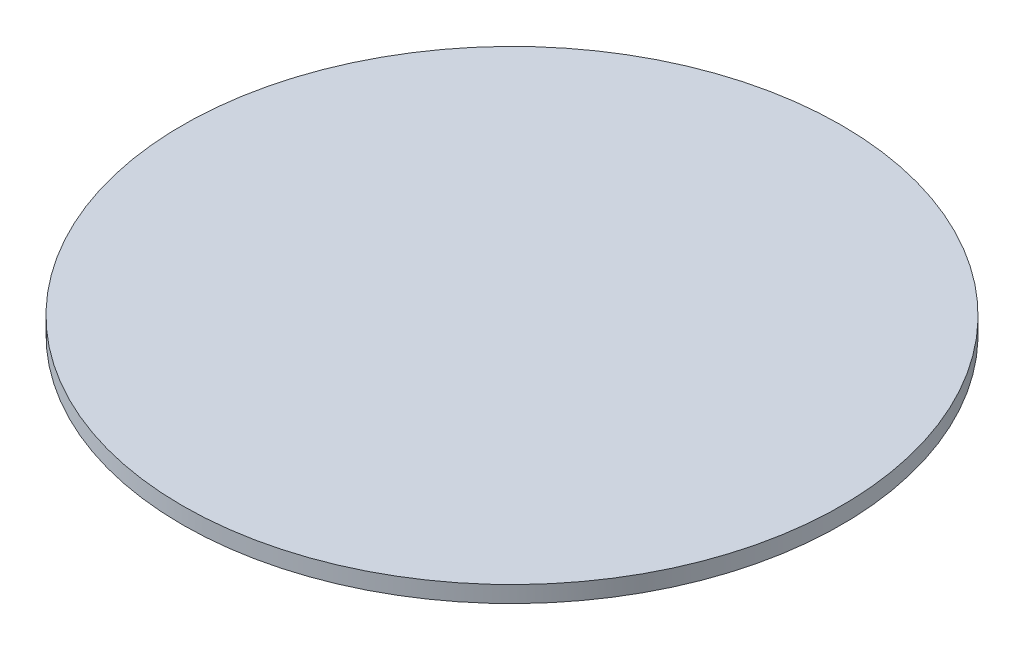
ISO-10303-21;
HEADER;
FILE_DESCRIPTION(('STEP AP214'),'2;1');
FILE_NAME('part.step','',(''),(''),'','','');
FILE_SCHEMA(('AUTOMOTIVE_DESIGN { 1 0 10303 214 1 1 1 1 }'));
ENDSEC;
DATA;
#1=APPLICATION_CONTEXT('core data for automotive mechanical design processes');
#2=APPLICATION_PROTOCOL_DEFINITION('international standard','automotive_design',2000,#1);
#3=PRODUCT_CONTEXT('',#1,'mechanical');
#4=PRODUCT('Part','Part','',(#3));
#5=PRODUCT_RELATED_PRODUCT_CATEGORY('part','',(#4));
#6=PRODUCT_DEFINITION_FORMATION('','',#4);
#7=PRODUCT_DEFINITION_CONTEXT('part definition',#1,'design');
#8=PRODUCT_DEFINITION('design','',#6,#7);
#9=PRODUCT_DEFINITION_SHAPE('','',#8);
#10=(LENGTH_UNIT() NAMED_UNIT(*) SI_UNIT(.MILLI.,.METRE.));
#11=(NAMED_UNIT(*) PLANE_ANGLE_UNIT() SI_UNIT($,.RADIAN.));
#12=(NAMED_UNIT(*) SI_UNIT($,.STERADIAN.) SOLID_ANGLE_UNIT());
#13=UNCERTAINTY_MEASURE_WITH_UNIT(LENGTH_MEASURE(1.E-05),#10,'distance_accuracy_value','');
#14=(GEOMETRIC_REPRESENTATION_CONTEXT(3) GLOBAL_UNCERTAINTY_ASSIGNED_CONTEXT((#13)) GLOBAL_UNIT_ASSIGNED_CONTEXT((#10,
#11,#12)) REPRESENTATION_CONTEXT('',''));
#15=CARTESIAN_POINT('',(0.,0.,0.));
#16=DIRECTION('',(0.,0.,1.));
#17=DIRECTION('',(1.,0.,0.));
#18=AXIS2_PLACEMENT_3D('',#15,#16,#17);
#19=CARTESIAN_POINT('',(0.,10.,0.));
#20=DIRECTION('',(0.,-1.,0.));
#21=DIRECTION('',(0.,0.,-1.));
#22=AXIS2_PLACEMENT_3D('',#19,#20,#21);
#23=CYLINDRICAL_SURFACE('',#22,200.);
#24=CARTESIAN_POINT('',(0.,10.,0.));
#25=DIRECTION('',(0.,1.,0.));
#26=DIRECTION('',(0.,0.,1.));
#27=AXIS2_PLACEMENT_3D('',#24,#25,#26);
#28=CIRCLE('',#27,200.);
#29=CARTESIAN_POINT('',(0.,10.,200.));
#30=VERTEX_POINT('',#29);
#31=EDGE_CURVE('E10',#30,#30,#28,.T.);
#32=ORIENTED_EDGE('',*,*,#31,.F.);
#33=EDGE_LOOP('',(#32));
#34=FACE_BOUND('',#33,.T.);
#35=CARTESIAN_POINT('',(0.,0.,0.));
#36=DIRECTION('',(0.,1.,0.));
#37=DIRECTION('',(0.,0.,1.));
#38=AXIS2_PLACEMENT_3D('',#35,#36,#37);
#39=CIRCLE('',#38,200.);
#40=CARTESIAN_POINT('',(0.,0.,200.));
#41=VERTEX_POINT('',#40);
#42=EDGE_CURVE('E32',#41,#41,#39,.T.);
#43=ORIENTED_EDGE('',*,*,#42,.T.);
#44=EDGE_LOOP('',(#43));
#45=FACE_BOUND('',#44,.T.);
#46=ADVANCED_FACE('F29',(#34,#45),#23,.T.);
#47=CARTESIAN_POINT('',(0.,10.,0.));
#48=DIRECTION('',(0.,1.,0.));
#49=DIRECTION('',(0.,0.,1.));
#50=AXIS2_PLACEMENT_3D('',#47,#48,#49);
#51=PLANE('',#50);
#52=ORIENTED_EDGE('',*,*,#31,.T.);
#53=EDGE_LOOP('',(#52));
#54=FACE_BOUND('',#53,.T.);
#55=ADVANCED_FACE('F44',(#54),#51,.T.);
#56=CARTESIAN_POINT('',(0.,0.,0.));
#57=DIRECTION('',(0.,1.,0.));
#58=DIRECTION('',(0.,0.,1.));
#59=AXIS2_PLACEMENT_3D('',#56,#57,#58);
#60=PLANE('',#59);
#61=ORIENTED_EDGE('',*,*,#42,.F.);
#62=EDGE_LOOP('',(#61));
#63=FACE_BOUND('',#62,.T.);
#64=ADVANCED_FACE('F42',(#63),#60,.F.);
#65=CLOSED_SHELL('',(#46,#55,#64));
#66=MANIFOLD_SOLID_BREP('B2',#65);
#67=ADVANCED_BREP_SHAPE_REPRESENTATION('',(#18,#66),#14);
#68=SHAPE_DEFINITION_REPRESENTATION(#9,#67);
ENDSEC;
END-ISO-10303-21;
